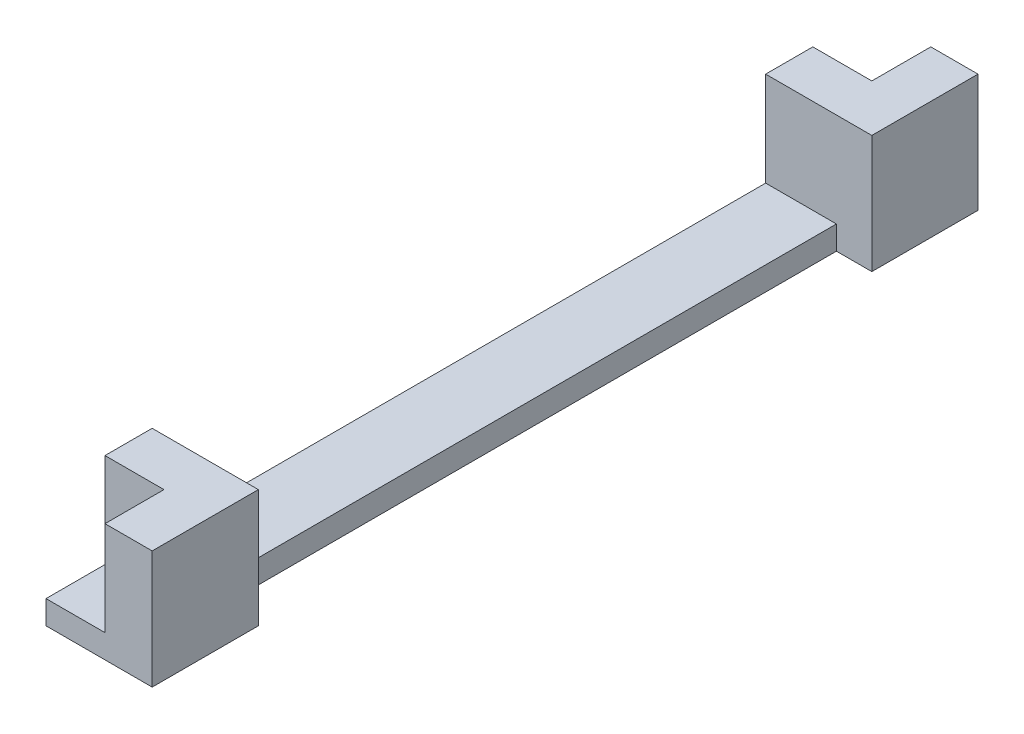
ISO-10303-21;
HEADER;
FILE_DESCRIPTION(('STEP AP214'),'2;1');
FILE_NAME('part.step','',(''),(''),'','','');
FILE_SCHEMA(('AUTOMOTIVE_DESIGN { 1 0 10303 214 1 1 1 1 }'));
ENDSEC;
DATA;
#1=APPLICATION_CONTEXT('core data for automotive mechanical design processes');
#2=APPLICATION_PROTOCOL_DEFINITION('international standard','automotive_design',2000,#1);
#3=PRODUCT_CONTEXT('',#1,'mechanical');
#4=PRODUCT('Part','Part','',(#3));
#5=PRODUCT_RELATED_PRODUCT_CATEGORY('part','',(#4));
#6=PRODUCT_DEFINITION_FORMATION('','',#4);
#7=PRODUCT_DEFINITION_CONTEXT('part definition',#1,'design');
#8=PRODUCT_DEFINITION('design','',#6,#7);
#9=PRODUCT_DEFINITION_SHAPE('','',#8);
#10=(LENGTH_UNIT() NAMED_UNIT(*) SI_UNIT(.MILLI.,.METRE.));
#11=(NAMED_UNIT(*) PLANE_ANGLE_UNIT() SI_UNIT($,.RADIAN.));
#12=(NAMED_UNIT(*) SI_UNIT($,.STERADIAN.) SOLID_ANGLE_UNIT());
#13=UNCERTAINTY_MEASURE_WITH_UNIT(LENGTH_MEASURE(1.E-05),#10,'distance_accuracy_value','');
#14=(GEOMETRIC_REPRESENTATION_CONTEXT(3) GLOBAL_UNCERTAINTY_ASSIGNED_CONTEXT((#13)) GLOBAL_UNIT_ASSIGNED_CONTEXT((#10,
#11,#12)) REPRESENTATION_CONTEXT('',''));
#15=CARTESIAN_POINT('',(0.,0.,0.));
#16=DIRECTION('',(0.,0.,1.));
#17=DIRECTION('',(1.,0.,0.));
#18=AXIS2_PLACEMENT_3D('',#15,#16,#17);
#19=CARTESIAN_POINT('',(4.5,10.,0.));
#20=DIRECTION('',(-1.,0.,0.));
#21=DIRECTION('',(0.,0.,1.));
#22=AXIS2_PLACEMENT_3D('',#19,#20,#21);
#23=PLANE('',#22);
#24=DIRECTION('',(0.,0.,-1.));
#25=VECTOR('',#24,1.);
#26=CARTESIAN_POINT('',(4.5,0.,0.));
#27=LINE('',#26,#25);
#28=CARTESIAN_POINT('',(4.5,0.,35.));
#29=VERTEX_POINT('',#28);
#30=CARTESIAN_POINT('',(4.5,0.,26.));
#31=VERTEX_POINT('',#30);
#32=EDGE_CURVE('E130',#29,#31,#27,.T.);
#33=ORIENTED_EDGE('',*,*,#32,.T.);
#34=DIRECTION('',(0.,-1.,0.));
#35=VECTOR('',#34,1.);
#36=CARTESIAN_POINT('',(4.5,10.,26.));
#37=LINE('',#36,#35);
#38=CARTESIAN_POINT('',(4.5,10.,26.));
#39=VERTEX_POINT('',#38);
#40=EDGE_CURVE('E122',#39,#31,#37,.T.);
#41=ORIENTED_EDGE('',*,*,#40,.F.);
#42=DIRECTION('',(0.,0.,-1.));
#43=VECTOR('',#42,1.);
#44=CARTESIAN_POINT('',(4.5,10.,0.));
#45=LINE('',#44,#43);
#46=CARTESIAN_POINT('',(4.5,10.,35.));
#47=VERTEX_POINT('',#46);
#48=EDGE_CURVE('E59',#47,#39,#45,.T.);
#49=ORIENTED_EDGE('',*,*,#48,.F.);
#50=DIRECTION('',(0.,-1.,0.));
#51=VECTOR('',#50,1.);
#52=CARTESIAN_POINT('',(4.5,10.,35.));
#53=LINE('',#52,#51);
#54=EDGE_CURVE('E71',#47,#29,#53,.T.);
#55=ORIENTED_EDGE('',*,*,#54,.T.);
#56=EDGE_LOOP('',(#33,#41,#49,#55));
#57=FACE_BOUND('',#56,.T.);
#58=ADVANCED_FACE('F35',(#57),#23,.F.);
#59=CARTESIAN_POINT('',(0.,2.,0.));
#60=DIRECTION('',(0.,-1.,0.));
#61=DIRECTION('',(0.,0.,-1.));
#62=AXIS2_PLACEMENT_3D('',#59,#60,#61);
#63=PLANE('',#62);
#64=DIRECTION('',(-1.,0.,0.));
#65=VECTOR('',#64,1.);
#66=CARTESIAN_POINT('',(0.,2.,26.));
#67=LINE('',#66,#65);
#68=CARTESIAN_POINT('',(1.5,2.,26.));
#69=VERTEX_POINT('',#68);
#70=CARTESIAN_POINT('',(-4.49999999999999,2.,26.));
#71=VERTEX_POINT('',#70);
#72=EDGE_CURVE('E127',#69,#71,#67,.T.);
#73=ORIENTED_EDGE('',*,*,#72,.F.);
#74=DIRECTION('',(0.,0.,1.));
#75=VECTOR('',#74,1.);
#76=CARTESIAN_POINT('',(1.5,2.,-26.));
#77=LINE('',#76,#75);
#78=CARTESIAN_POINT('',(1.5,2.,-26.));
#79=VERTEX_POINT('',#78);
#80=EDGE_CURVE('E297',#79,#69,#77,.T.);
#81=ORIENTED_EDGE('',*,*,#80,.F.);
#82=DIRECTION('',(1.,0.,0.));
#83=VECTOR('',#82,1.);
#84=CARTESIAN_POINT('',(0.,2.,-26.));
#85=LINE('',#84,#83);
#86=CARTESIAN_POINT('',(-4.5,2.,-26.));
#87=VERTEX_POINT('',#86);
#88=EDGE_CURVE('E11',#87,#79,#85,.T.);
#89=ORIENTED_EDGE('',*,*,#88,.F.);
#90=DIRECTION('',(0.,0.,1.));
#91=VECTOR('',#90,1.);
#92=CARTESIAN_POINT('',(-4.5,2.,-35.));
#93=LINE('',#92,#91);
#94=EDGE_CURVE('E197',#87,#71,#93,.T.);
#95=ORIENTED_EDGE('',*,*,#94,.T.);
#96=EDGE_LOOP('',(#73,#81,#89,#95));
#97=FACE_BOUND('',#96,.T.);
#98=ADVANCED_FACE('F232',(#97),#63,.F.);
#99=DIRECTION('',(0.,0.,1.));
#100=VECTOR('',#99,1.);
#101=CARTESIAN_POINT('',(0.500000000000005,2.,0.));
#102=LINE('',#101,#100);
#103=CARTESIAN_POINT('',(0.499999999999999,2.,-35.));
#104=VERTEX_POINT('',#103);
#105=CARTESIAN_POINT('',(0.5,2.,-30.));
#106=VERTEX_POINT('',#105);
#107=EDGE_CURVE('E43',#104,#106,#102,.T.);
#108=ORIENTED_EDGE('',*,*,#107,.F.);
#109=DIRECTION('',(-1.,0.,0.));
#110=VECTOR('',#109,1.);
#111=CARTESIAN_POINT('',(4.5,2.,-35.));
#112=LINE('',#111,#110);
#113=CARTESIAN_POINT('',(-4.5,2.,-35.));
#114=VERTEX_POINT('',#113);
#115=EDGE_CURVE('E192',#104,#114,#112,.T.);
#116=ORIENTED_EDGE('',*,*,#115,.T.);
#117=CARTESIAN_POINT('',(-4.5,2.,-30.));
#118=VERTEX_POINT('',#117);
#119=EDGE_CURVE('E161',#114,#118,#93,.T.);
#120=ORIENTED_EDGE('',*,*,#119,.T.);
#121=DIRECTION('',(1.,0.,0.));
#122=VECTOR('',#121,1.);
#123=CARTESIAN_POINT('',(0.,2.,-30.));
#124=LINE('',#123,#122);
#125=EDGE_CURVE('E143',#118,#106,#124,.T.);
#126=ORIENTED_EDGE('',*,*,#125,.T.);
#127=EDGE_LOOP('',(#108,#116,#120,#126));
#128=FACE_BOUND('',#127,.T.);
#129=ADVANCED_FACE('F158',(#128),#63,.F.);
#130=CARTESIAN_POINT('',(0.,10.,26.));
#131=DIRECTION('',(0.,0.,-1.));
#132=DIRECTION('',(-1.,0.,0.));
#133=AXIS2_PLACEMENT_3D('',#130,#131,#132);
#134=PLANE('',#133);
#135=ORIENTED_EDGE('',*,*,#40,.T.);
#136=DIRECTION('',(1.,0.,0.));
#137=VECTOR('',#136,1.);
#138=CARTESIAN_POINT('',(4.5,0.,26.));
#139=LINE('',#138,#137);
#140=CARTESIAN_POINT('',(1.5,0.,26.));
#141=VERTEX_POINT('',#140);
#142=EDGE_CURVE('E315',#141,#31,#139,.T.);
#143=ORIENTED_EDGE('',*,*,#142,.F.);
#144=DIRECTION('',(0.,1.,0.));
#145=VECTOR('',#144,1.);
#146=CARTESIAN_POINT('',(1.5,0.,26.));
#147=LINE('',#146,#145);
#148=EDGE_CURVE('E227',#141,#69,#147,.T.);
#149=ORIENTED_EDGE('',*,*,#148,.T.);
#150=ORIENTED_EDGE('',*,*,#72,.T.);
#151=DIRECTION('',(0.,-1.,0.));
#152=VECTOR('',#151,1.);
#153=CARTESIAN_POINT('',(-4.5,10.,26.));
#154=LINE('',#153,#152);
#155=CARTESIAN_POINT('',(-4.5,10.,26.));
#156=VERTEX_POINT('',#155);
#157=EDGE_CURVE('E140',#156,#71,#154,.T.);
#158=ORIENTED_EDGE('',*,*,#157,.F.);
#159=DIRECTION('',(1.,0.,0.));
#160=VECTOR('',#159,1.);
#161=CARTESIAN_POINT('',(0.,10.,26.));
#162=LINE('',#161,#160);
#163=EDGE_CURVE('E132',#156,#39,#162,.T.);
#164=ORIENTED_EDGE('',*,*,#163,.T.);
#165=EDGE_LOOP('',(#135,#143,#149,#150,#158,#164));
#166=FACE_BOUND('',#165,.T.);
#167=ADVANCED_FACE('F37',(#166),#134,.T.);
#168=CARTESIAN_POINT('',(0.,10.,30.));
#169=DIRECTION('',(0.,0.,-1.));
#170=DIRECTION('',(-1.,0.,0.));
#171=AXIS2_PLACEMENT_3D('',#168,#169,#170);
#172=PLANE('',#171);
#173=DIRECTION('',(-1.,0.,0.));
#174=VECTOR('',#173,1.);
#175=CARTESIAN_POINT('',(0.,2.,30.));
#176=LINE('',#175,#174);
#177=CARTESIAN_POINT('',(0.499999999999999,2.,30.));
#178=VERTEX_POINT('',#177);
#179=CARTESIAN_POINT('',(-4.49999999999999,2.,30.));
#180=VERTEX_POINT('',#179);
#181=EDGE_CURVE('E210',#178,#180,#176,.T.);
#182=ORIENTED_EDGE('',*,*,#181,.F.);
#183=DIRECTION('',(0.,-1.,0.));
#184=VECTOR('',#183,1.);
#185=CARTESIAN_POINT('',(0.499999999999999,10.,30.));
#186=LINE('',#185,#184);
#187=CARTESIAN_POINT('',(0.499999999999999,10.,30.));
#188=VERTEX_POINT('',#187);
#189=EDGE_CURVE('E106',#188,#178,#186,.T.);
#190=ORIENTED_EDGE('',*,*,#189,.F.);
#191=DIRECTION('',(1.,0.,0.));
#192=VECTOR('',#191,1.);
#193=CARTESIAN_POINT('',(0.,10.,30.));
#194=LINE('',#193,#192);
#195=CARTESIAN_POINT('',(-4.5,10.,30.));
#196=VERTEX_POINT('',#195);
#197=EDGE_CURVE('E114',#196,#188,#194,.T.);
#198=ORIENTED_EDGE('',*,*,#197,.F.);
#199=DIRECTION('',(0.,-1.,0.));
#200=VECTOR('',#199,1.);
#201=CARTESIAN_POINT('',(-4.5,10.,30.));
#202=LINE('',#201,#200);
#203=EDGE_CURVE('E137',#196,#180,#202,.T.);
#204=ORIENTED_EDGE('',*,*,#203,.T.);
#205=EDGE_LOOP('',(#182,#190,#198,#204));
#206=FACE_BOUND('',#205,.T.);
#207=ADVANCED_FACE('F347',(#206),#172,.F.);
#208=CARTESIAN_POINT('',(0.499999999999999,10.,0.));
#209=DIRECTION('',(-1.,0.,0.));
#210=DIRECTION('',(0.,0.,1.));
#211=AXIS2_PLACEMENT_3D('',#208,#209,#210);
#212=PLANE('',#211);
#213=ORIENTED_EDGE('',*,*,#189,.T.);
#214=DIRECTION('',(0.,0.,1.));
#215=VECTOR('',#214,1.);
#216=CARTESIAN_POINT('',(0.499999999999999,2.,0.));
#217=LINE('',#216,#215);
#218=CARTESIAN_POINT('',(0.499999999999999,2.,35.));
#219=VERTEX_POINT('',#218);
#220=EDGE_CURVE('E83',#178,#219,#217,.T.);
#221=ORIENTED_EDGE('',*,*,#220,.T.);
#222=DIRECTION('',(0.,-1.,0.));
#223=VECTOR('',#222,1.);
#224=CARTESIAN_POINT('',(0.499999999999999,10.,35.));
#225=LINE('',#224,#223);
#226=CARTESIAN_POINT('',(0.499999999999999,10.,35.));
#227=VERTEX_POINT('',#226);
#228=EDGE_CURVE('E97',#227,#219,#225,.T.);
#229=ORIENTED_EDGE('',*,*,#228,.F.);
#230=DIRECTION('',(0.,0.,-1.));
#231=VECTOR('',#230,1.);
#232=CARTESIAN_POINT('',(0.499999999999999,10.,0.));
#233=LINE('',#232,#231);
#234=EDGE_CURVE('E102',#227,#188,#233,.T.);
#235=ORIENTED_EDGE('',*,*,#234,.T.);
#236=EDGE_LOOP('',(#213,#221,#229,#235));
#237=FACE_BOUND('',#236,.T.);
#238=ADVANCED_FACE('F100',(#237),#212,.T.);
#239=CARTESIAN_POINT('',(-4.5,10.,0.));
#240=DIRECTION('',(-1.,0.,0.));
#241=DIRECTION('',(0.,0.,1.));
#242=AXIS2_PLACEMENT_3D('',#239,#240,#241);
#243=PLANE('',#242);
#244=DIRECTION('',(0.,-1.,0.));
#245=VECTOR('',#244,1.);
#246=CARTESIAN_POINT('',(-4.5,2.,-35.));
#247=LINE('',#246,#245);
#248=CARTESIAN_POINT('',(-4.5,0.,-35.));
#249=VERTEX_POINT('',#248);
#250=EDGE_CURVE('E204',#114,#249,#247,.T.);
#251=ORIENTED_EDGE('',*,*,#250,.T.);
#252=DIRECTION('',(0.,0.,-1.));
#253=VECTOR('',#252,1.);
#254=CARTESIAN_POINT('',(-4.5,0.,0.));
#255=LINE('',#254,#253);
#256=CARTESIAN_POINT('',(-4.49999999999999,0.,35.));
#257=VERTEX_POINT('',#256);
#258=EDGE_CURVE('E123',#257,#249,#255,.T.);
#259=ORIENTED_EDGE('',*,*,#258,.F.);
#260=DIRECTION('',(0.,-1.,0.));
#261=VECTOR('',#260,1.);
#262=CARTESIAN_POINT('',(-4.49999999999999,2.,35.));
#263=LINE('',#262,#261);
#264=CARTESIAN_POINT('',(-4.49999999999999,2.,35.));
#265=VERTEX_POINT('',#264);
#266=EDGE_CURVE('E199',#265,#257,#263,.T.);
#267=ORIENTED_EDGE('',*,*,#266,.F.);
#268=EDGE_CURVE('E194',#180,#265,#93,.T.);
#269=ORIENTED_EDGE('',*,*,#268,.F.);
#270=ORIENTED_EDGE('',*,*,#203,.F.);
#271=DIRECTION('',(0.,0.,-1.));
#272=VECTOR('',#271,1.);
#273=CARTESIAN_POINT('',(-4.5,10.,0.));
#274=LINE('',#273,#272);
#275=EDGE_CURVE('E117',#196,#156,#274,.T.);
#276=ORIENTED_EDGE('',*,*,#275,.T.);
#277=ORIENTED_EDGE('',*,*,#157,.T.);
#278=ORIENTED_EDGE('',*,*,#94,.F.);
#279=DIRECTION('',(0.,-1.,0.));
#280=VECTOR('',#279,1.);
#281=CARTESIAN_POINT('',(-4.5,10.,-26.));
#282=LINE('',#281,#280);
#283=CARTESIAN_POINT('',(-4.5,10.,-26.));
#284=VERTEX_POINT('',#283);
#285=EDGE_CURVE('E188',#284,#87,#282,.T.);
#286=ORIENTED_EDGE('',*,*,#285,.F.);
#287=DIRECTION('',(0.,0.,-1.));
#288=VECTOR('',#287,1.);
#289=CARTESIAN_POINT('',(-4.5,10.,0.));
#290=LINE('',#289,#288);
#291=CARTESIAN_POINT('',(-4.5,10.,-30.));
#292=VERTEX_POINT('',#291);
#293=EDGE_CURVE('E175',#284,#292,#290,.T.);
#294=ORIENTED_EDGE('',*,*,#293,.T.);
#295=DIRECTION('',(0.,-1.,0.));
#296=VECTOR('',#295,1.);
#297=CARTESIAN_POINT('',(-4.5,10.,-30.));
#298=LINE('',#297,#296);
#299=EDGE_CURVE('E166',#292,#118,#298,.T.);
#300=ORIENTED_EDGE('',*,*,#299,.T.);
#301=ORIENTED_EDGE('',*,*,#119,.F.);
#302=EDGE_LOOP('',(#251,#259,#267,#269,#270,#276,#277,#278,#286,#294,#300,#301));
#303=FACE_BOUND('',#302,.T.);
#304=ADVANCED_FACE('F171',(#303),#243,.T.);
#305=CARTESIAN_POINT('',(0.,10.,35.));
#306=DIRECTION('',(0.,0.,-1.));
#307=DIRECTION('',(-1.,0.,0.));
#308=AXIS2_PLACEMENT_3D('',#305,#306,#307);
#309=PLANE('',#308);
#310=DIRECTION('',(1.,0.,0.));
#311=VECTOR('',#310,1.);
#312=CARTESIAN_POINT('',(0.,0.,35.));
#313=LINE('',#312,#311);
#314=EDGE_CURVE('E126',#257,#29,#313,.T.);
#315=ORIENTED_EDGE('',*,*,#314,.T.);
#316=ORIENTED_EDGE('',*,*,#54,.F.);
#317=DIRECTION('',(1.,0.,0.));
#318=VECTOR('',#317,1.);
#319=CARTESIAN_POINT('',(0.,10.,35.));
#320=LINE('',#319,#318);
#321=EDGE_CURVE('E108',#227,#47,#320,.T.);
#322=ORIENTED_EDGE('',*,*,#321,.F.);
#323=ORIENTED_EDGE('',*,*,#228,.T.);
#324=DIRECTION('',(1.,0.,0.));
#325=VECTOR('',#324,1.);
#326=CARTESIAN_POINT('',(4.50000000000001,2.,35.));
#327=LINE('',#326,#325);
#328=EDGE_CURVE('E196',#265,#219,#327,.T.);
#329=ORIENTED_EDGE('',*,*,#328,.F.);
#330=ORIENTED_EDGE('',*,*,#266,.T.);
#331=EDGE_LOOP('',(#315,#316,#322,#323,#329,#330));
#332=FACE_BOUND('',#331,.T.);
#333=ADVANCED_FACE('F109',(#332),#309,.F.);
#334=DIRECTION('',(0.,-1.,0.));
#335=VECTOR('',#334,1.);
#336=CARTESIAN_POINT('',(4.5,10.,-26.));
#337=LINE('',#336,#335);
#338=CARTESIAN_POINT('',(4.5,10.,-26.));
#339=VERTEX_POINT('',#338);
#340=CARTESIAN_POINT('',(4.5,0.,-26.));
#341=VERTEX_POINT('',#340);
#342=EDGE_CURVE('E185',#339,#341,#337,.T.);
#343=ORIENTED_EDGE('',*,*,#342,.T.);
#344=CARTESIAN_POINT('',(4.5,0.,-35.));
#345=VERTEX_POINT('',#344);
#346=EDGE_CURVE('E129',#341,#345,#27,.T.);
#347=ORIENTED_EDGE('',*,*,#346,.T.);
#348=DIRECTION('',(0.,-1.,0.));
#349=VECTOR('',#348,1.);
#350=CARTESIAN_POINT('',(4.5,2.,-35.));
#351=LINE('',#350,#349);
#352=CARTESIAN_POINT('',(4.5,10.,-35.));
#353=VERTEX_POINT('',#352);
#354=EDGE_CURVE('E206',#353,#345,#351,.T.);
#355=ORIENTED_EDGE('',*,*,#354,.F.);
#356=DIRECTION('',(0.,0.,-1.));
#357=VECTOR('',#356,1.);
#358=CARTESIAN_POINT('',(4.5,10.,0.));
#359=LINE('',#358,#357);
#360=EDGE_CURVE('E286',#339,#353,#359,.T.);
#361=ORIENTED_EDGE('',*,*,#360,.F.);
#362=EDGE_LOOP('',(#343,#347,#355,#361));
#363=FACE_BOUND('',#362,.T.);
#364=ADVANCED_FACE('F282',(#363),#23,.F.);
#365=CARTESIAN_POINT('',(0.,10.,0.));
#366=DIRECTION('',(0.,1.,0.));
#367=DIRECTION('',(0.,0.,1.));
#368=AXIS2_PLACEMENT_3D('',#365,#366,#367);
#369=PLANE('',#368);
#370=ORIENTED_EDGE('',*,*,#163,.F.);
#371=ORIENTED_EDGE('',*,*,#275,.F.);
#372=ORIENTED_EDGE('',*,*,#197,.T.);
#373=ORIENTED_EDGE('',*,*,#234,.F.);
#374=ORIENTED_EDGE('',*,*,#321,.T.);
#375=ORIENTED_EDGE('',*,*,#48,.T.);
#376=EDGE_LOOP('',(#370,#371,#372,#373,#374,#375));
#377=FACE_BOUND('',#376,.T.);
#378=ADVANCED_FACE('F111',(#377),#369,.T.);
#379=CARTESIAN_POINT('',(0.,0.,0.));
#380=DIRECTION('',(0.,1.,0.));
#381=DIRECTION('',(0.,0.,1.));
#382=AXIS2_PLACEMENT_3D('',#379,#380,#381);
#383=PLANE('',#382);
#384=DIRECTION('',(0.,0.,1.));
#385=VECTOR('',#384,1.);
#386=CARTESIAN_POINT('',(1.5,0.,-26.));
#387=LINE('',#386,#385);
#388=CARTESIAN_POINT('',(1.5,0.,-26.));
#389=VERTEX_POINT('',#388);
#390=EDGE_CURVE('E296',#389,#141,#387,.T.);
#391=ORIENTED_EDGE('',*,*,#390,.T.);
#392=ORIENTED_EDGE('',*,*,#142,.T.);
#393=ORIENTED_EDGE('',*,*,#32,.F.);
#394=ORIENTED_EDGE('',*,*,#314,.F.);
#395=ORIENTED_EDGE('',*,*,#258,.T.);
#396=DIRECTION('',(-1.,0.,0.));
#397=VECTOR('',#396,1.);
#398=CARTESIAN_POINT('',(4.5,0.,-35.));
#399=LINE('',#398,#397);
#400=EDGE_CURVE('E191',#345,#249,#399,.T.);
#401=ORIENTED_EDGE('',*,*,#400,.F.);
#402=ORIENTED_EDGE('',*,*,#346,.F.);
#403=DIRECTION('',(-1.,0.,0.));
#404=VECTOR('',#403,1.);
#405=CARTESIAN_POINT('',(4.5,0.,-26.));
#406=LINE('',#405,#404);
#407=EDGE_CURVE('E290',#341,#389,#406,.T.);
#408=ORIENTED_EDGE('',*,*,#407,.T.);
#409=EDGE_LOOP('',(#391,#392,#393,#394,#395,#401,#402,#408));
#410=FACE_BOUND('',#409,.T.);
#411=ADVANCED_FACE('F299',(#410),#383,.F.);
#412=ORIENTED_EDGE('',*,*,#220,.F.);
#413=ORIENTED_EDGE('',*,*,#181,.T.);
#414=ORIENTED_EDGE('',*,*,#268,.T.);
#415=ORIENTED_EDGE('',*,*,#328,.T.);
#416=EDGE_LOOP('',(#412,#413,#414,#415));
#417=FACE_BOUND('',#416,.T.);
#418=ADVANCED_FACE('F237',(#417),#63,.F.);
#419=CARTESIAN_POINT('',(4.5,2.,-35.));
#420=DIRECTION('',(0.,0.,1.));
#421=DIRECTION('',(1.,0.,0.));
#422=AXIS2_PLACEMENT_3D('',#419,#420,#421);
#423=PLANE('',#422);
#424=ORIENTED_EDGE('',*,*,#400,.T.);
#425=ORIENTED_EDGE('',*,*,#250,.F.);
#426=ORIENTED_EDGE('',*,*,#115,.F.);
#427=DIRECTION('',(0.,-1.,0.));
#428=VECTOR('',#427,1.);
#429=CARTESIAN_POINT('',(0.499999999999999,10.,-35.));
#430=LINE('',#429,#428);
#431=CARTESIAN_POINT('',(0.499999999999999,10.,-35.));
#432=VERTEX_POINT('',#431);
#433=EDGE_CURVE('E153',#432,#104,#430,.T.);
#434=ORIENTED_EDGE('',*,*,#433,.F.);
#435=DIRECTION('',(1.,0.,0.));
#436=VECTOR('',#435,1.);
#437=CARTESIAN_POINT('',(0.,10.,-35.));
#438=LINE('',#437,#436);
#439=EDGE_CURVE('E305',#432,#353,#438,.T.);
#440=ORIENTED_EDGE('',*,*,#439,.T.);
#441=ORIENTED_EDGE('',*,*,#354,.T.);
#442=EDGE_LOOP('',(#424,#425,#426,#434,#440,#441));
#443=FACE_BOUND('',#442,.T.);
#444=ADVANCED_FACE('F303',(#443),#423,.F.);
#445=CARTESIAN_POINT('',(0.,10.,-26.));
#446=DIRECTION('',(0.,0.,-1.));
#447=DIRECTION('',(-1.,0.,0.));
#448=AXIS2_PLACEMENT_3D('',#445,#446,#447);
#449=PLANE('',#448);
#450=ORIENTED_EDGE('',*,*,#285,.T.);
#451=ORIENTED_EDGE('',*,*,#88,.T.);
#452=DIRECTION('',(0.,1.,0.));
#453=VECTOR('',#452,1.);
#454=CARTESIAN_POINT('',(1.5,0.,-26.));
#455=LINE('',#454,#453);
#456=EDGE_CURVE('E292',#389,#79,#455,.T.);
#457=ORIENTED_EDGE('',*,*,#456,.F.);
#458=ORIENTED_EDGE('',*,*,#407,.F.);
#459=ORIENTED_EDGE('',*,*,#342,.F.);
#460=DIRECTION('',(1.,0.,0.));
#461=VECTOR('',#460,1.);
#462=CARTESIAN_POINT('',(0.,10.,-26.));
#463=LINE('',#462,#461);
#464=EDGE_CURVE('E308',#284,#339,#463,.T.);
#465=ORIENTED_EDGE('',*,*,#464,.F.);
#466=EDGE_LOOP('',(#450,#451,#457,#458,#459,#465));
#467=FACE_BOUND('',#466,.T.);
#468=ADVANCED_FACE('F291',(#467),#449,.F.);
#469=CARTESIAN_POINT('',(0.500000000000005,10.,0.));
#470=DIRECTION('',(1.,0.,0.));
#471=DIRECTION('',(0.,0.,-1.));
#472=AXIS2_PLACEMENT_3D('',#469,#470,#471);
#473=PLANE('',#472);
#474=ORIENTED_EDGE('',*,*,#433,.T.);
#475=ORIENTED_EDGE('',*,*,#107,.T.);
#476=DIRECTION('',(0.,-1.,0.));
#477=VECTOR('',#476,1.);
#478=CARTESIAN_POINT('',(0.5,10.,-30.));
#479=LINE('',#478,#477);
#480=CARTESIAN_POINT('',(0.5,10.,-30.));
#481=VERTEX_POINT('',#480);
#482=EDGE_CURVE('E50',#481,#106,#479,.T.);
#483=ORIENTED_EDGE('',*,*,#482,.F.);
#484=DIRECTION('',(0.,0.,1.));
#485=VECTOR('',#484,1.);
#486=CARTESIAN_POINT('',(0.500000000000005,10.,0.));
#487=LINE('',#486,#485);
#488=EDGE_CURVE('E180',#432,#481,#487,.T.);
#489=ORIENTED_EDGE('',*,*,#488,.F.);
#490=EDGE_LOOP('',(#474,#475,#483,#489));
#491=FACE_BOUND('',#490,.T.);
#492=ADVANCED_FACE('F148',(#491),#473,.F.);
#493=CARTESIAN_POINT('',(0.,10.,-30.));
#494=DIRECTION('',(0.,0.,-1.));
#495=DIRECTION('',(-1.,0.,0.));
#496=AXIS2_PLACEMENT_3D('',#493,#494,#495);
#497=PLANE('',#496);
#498=ORIENTED_EDGE('',*,*,#125,.F.);
#499=ORIENTED_EDGE('',*,*,#299,.F.);
#500=DIRECTION('',(1.,0.,0.));
#501=VECTOR('',#500,1.);
#502=CARTESIAN_POINT('',(0.,10.,-30.));
#503=LINE('',#502,#501);
#504=EDGE_CURVE('E177',#292,#481,#503,.T.);
#505=ORIENTED_EDGE('',*,*,#504,.T.);
#506=ORIENTED_EDGE('',*,*,#482,.T.);
#507=EDGE_LOOP('',(#498,#499,#505,#506));
#508=FACE_BOUND('',#507,.T.);
#509=ADVANCED_FACE('F164',(#508),#497,.T.);
#510=CARTESIAN_POINT('',(0.,10.,0.));
#511=DIRECTION('',(0.,1.,0.));
#512=DIRECTION('',(0.,0.,1.));
#513=AXIS2_PLACEMENT_3D('',#510,#511,#512);
#514=PLANE('',#513);
#515=ORIENTED_EDGE('',*,*,#293,.F.);
#516=ORIENTED_EDGE('',*,*,#464,.T.);
#517=ORIENTED_EDGE('',*,*,#360,.T.);
#518=ORIENTED_EDGE('',*,*,#439,.F.);
#519=ORIENTED_EDGE('',*,*,#488,.T.);
#520=ORIENTED_EDGE('',*,*,#504,.F.);
#521=EDGE_LOOP('',(#515,#516,#517,#518,#519,#520));
#522=FACE_BOUND('',#521,.T.);
#523=ADVANCED_FACE('F307',(#522),#514,.T.);
#524=CARTESIAN_POINT('',(1.5,0.,-26.));
#525=DIRECTION('',(-1.,0.,0.));
#526=DIRECTION('',(0.,0.,1.));
#527=AXIS2_PLACEMENT_3D('',#524,#525,#526);
#528=PLANE('',#527);
#529=ORIENTED_EDGE('',*,*,#80,.T.);
#530=ORIENTED_EDGE('',*,*,#148,.F.);
#531=ORIENTED_EDGE('',*,*,#390,.F.);
#532=ORIENTED_EDGE('',*,*,#456,.T.);
#533=EDGE_LOOP('',(#529,#530,#531,#532));
#534=FACE_BOUND('',#533,.T.);
#535=ADVANCED_FACE('F320',(#534),#528,.F.);
#536=CLOSED_SHELL('',(#58,#98,#129,#167,#207,#238,#304,#333,#364,#378,#411,#418,#444,#468,#492,
#509,#523,#535));
#537=MANIFOLD_SOLID_BREP('B2',#536);
#538=ADVANCED_BREP_SHAPE_REPRESENTATION('',(#18,#537),#14);
#539=SHAPE_DEFINITION_REPRESENTATION(#9,#538);
ENDSEC;
END-ISO-10303-21;
